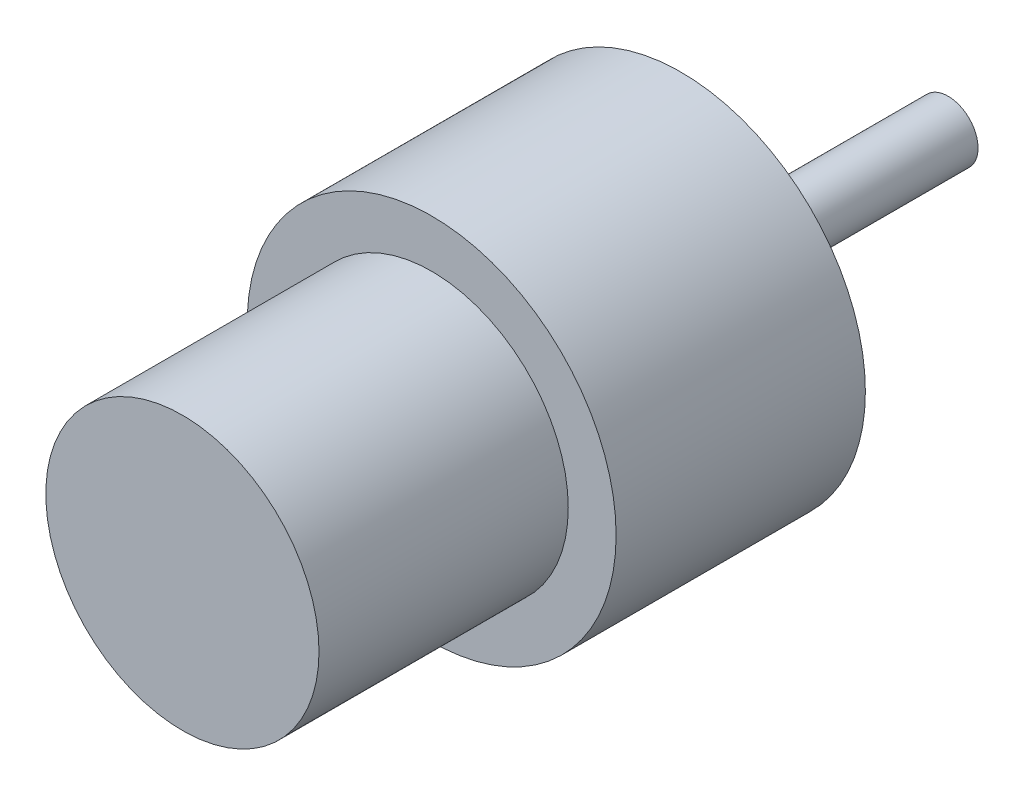
ISO-10303-21;
HEADER;
FILE_DESCRIPTION(('STEP AP214'),'2;1');
FILE_NAME('part.step','',(''),(''),'','','');
FILE_SCHEMA(('AUTOMOTIVE_DESIGN { 1 0 10303 214 1 1 1 1 }'));
ENDSEC;
DATA;
#1=APPLICATION_CONTEXT('core data for automotive mechanical design processes');
#2=APPLICATION_PROTOCOL_DEFINITION('international standard','automotive_design',2000,#1);
#3=PRODUCT_CONTEXT('',#1,'mechanical');
#4=PRODUCT('Part','Part','',(#3));
#5=PRODUCT_RELATED_PRODUCT_CATEGORY('part','',(#4));
#6=PRODUCT_DEFINITION_FORMATION('','',#4);
#7=PRODUCT_DEFINITION_CONTEXT('part definition',#1,'design');
#8=PRODUCT_DEFINITION('design','',#6,#7);
#9=PRODUCT_DEFINITION_SHAPE('','',#8);
#10=(LENGTH_UNIT() NAMED_UNIT(*) SI_UNIT(.MILLI.,.METRE.));
#11=(NAMED_UNIT(*) PLANE_ANGLE_UNIT() SI_UNIT($,.RADIAN.));
#12=(NAMED_UNIT(*) SI_UNIT($,.STERADIAN.) SOLID_ANGLE_UNIT());
#13=UNCERTAINTY_MEASURE_WITH_UNIT(LENGTH_MEASURE(1.E-05),#10,'distance_accuracy_value','');
#14=(GEOMETRIC_REPRESENTATION_CONTEXT(3) GLOBAL_UNCERTAINTY_ASSIGNED_CONTEXT((#13)) GLOBAL_UNIT_ASSIGNED_CONTEXT((#10,
#11,#12)) REPRESENTATION_CONTEXT('',''));
#15=CARTESIAN_POINT('',(0.,0.,0.));
#16=DIRECTION('',(0.,0.,1.));
#17=DIRECTION('',(1.,0.,0.));
#18=AXIS2_PLACEMENT_3D('',#15,#16,#17);
#19=CARTESIAN_POINT('',(0.,0.,25.));
#20=DIRECTION('',(0.,0.,-1.));
#21=DIRECTION('',(-1.,0.,0.));
#22=AXIS2_PLACEMENT_3D('',#19,#20,#21);
#23=CYLINDRICAL_SURFACE('',#22,18.5);
#24=CARTESIAN_POINT('',(0.,0.,25.));
#25=DIRECTION('',(0.,0.,1.));
#26=DIRECTION('',(1.,0.,0.));
#27=AXIS2_PLACEMENT_3D('',#24,#25,#26);
#28=CIRCLE('',#27,18.5);
#29=CARTESIAN_POINT('',(18.5,0.,25.));
#30=VERTEX_POINT('',#29);
#31=EDGE_CURVE('E61',#30,#30,#28,.T.);
#32=ORIENTED_EDGE('',*,*,#31,.F.);
#33=EDGE_LOOP('',(#32));
#34=FACE_BOUND('',#33,.T.);
#35=CARTESIAN_POINT('',(0.,0.,0.));
#36=DIRECTION('',(0.,0.,1.));
#37=DIRECTION('',(1.,0.,0.));
#38=AXIS2_PLACEMENT_3D('',#35,#36,#37);
#39=CIRCLE('',#38,18.5);
#40=CARTESIAN_POINT('',(18.5,0.,0.));
#41=VERTEX_POINT('',#40);
#42=EDGE_CURVE('E40',#41,#41,#39,.T.);
#43=ORIENTED_EDGE('',*,*,#42,.T.);
#44=EDGE_LOOP('',(#43));
#45=FACE_BOUND('',#44,.T.);
#46=ADVANCED_FACE('F37',(#34,#45),#23,.T.);
#47=CARTESIAN_POINT('',(0.,0.,25.));
#48=DIRECTION('',(0.,0.,1.));
#49=DIRECTION('',(1.,0.,0.));
#50=AXIS2_PLACEMENT_3D('',#47,#48,#49);
#51=PLANE('',#50);
#52=CARTESIAN_POINT('',(0.,0.,25.));
#53=DIRECTION('',(0.,0.,1.));
#54=DIRECTION('',(1.,0.,0.));
#55=AXIS2_PLACEMENT_3D('',#52,#53,#54);
#56=CIRCLE('',#55,13.7);
#57=CARTESIAN_POINT('',(13.7,0.,25.));
#58=VERTEX_POINT('',#57);
#59=EDGE_CURVE('E10',#58,#58,#56,.T.);
#60=ORIENTED_EDGE('',*,*,#59,.F.);
#61=EDGE_LOOP('',(#60));
#62=FACE_BOUND('',#61,.T.);
#63=ORIENTED_EDGE('',*,*,#31,.T.);
#64=EDGE_LOOP('',(#63));
#65=FACE_BOUND('',#64,.T.);
#66=ADVANCED_FACE('F72',(#62,#65),#51,.T.);
#67=CARTESIAN_POINT('',(0.,0.,0.));
#68=DIRECTION('',(0.,0.,1.));
#69=DIRECTION('',(1.,0.,0.));
#70=AXIS2_PLACEMENT_3D('',#67,#68,#69);
#71=PLANE('',#70);
#72=CARTESIAN_POINT('',(0.,0.,0.));
#73=DIRECTION('',(0.,0.,-1.));
#74=DIRECTION('',(-1.,0.,0.));
#75=AXIS2_PLACEMENT_3D('',#72,#73,#74);
#76=CIRCLE('',#75,6.);
#77=CARTESIAN_POINT('',(-6.,0.,0.));
#78=VERTEX_POINT('',#77);
#79=EDGE_CURVE('E49',#78,#78,#76,.T.);
#80=ORIENTED_EDGE('',*,*,#79,.F.);
#81=EDGE_LOOP('',(#80));
#82=FACE_BOUND('',#81,.T.);
#83=ORIENTED_EDGE('',*,*,#42,.F.);
#84=EDGE_LOOP('',(#83));
#85=FACE_BOUND('',#84,.T.);
#86=ADVANCED_FACE('F69',(#82,#85),#71,.F.);
#87=CARTESIAN_POINT('',(0.,0.,-6.8));
#88=DIRECTION('',(0.,0.,1.));
#89=DIRECTION('',(1.,0.,0.));
#90=AXIS2_PLACEMENT_3D('',#87,#88,#89);
#91=CYLINDRICAL_SURFACE('',#90,6.);
#92=CARTESIAN_POINT('',(0.,0.,-6.8));
#93=DIRECTION('',(0.,0.,-1.));
#94=DIRECTION('',(-1.,0.,0.));
#95=AXIS2_PLACEMENT_3D('',#92,#93,#94);
#96=CIRCLE('',#95,6.);
#97=CARTESIAN_POINT('',(-6.,0.,-6.8));
#98=VERTEX_POINT('',#97);
#99=EDGE_CURVE('E56',#98,#98,#96,.T.);
#100=ORIENTED_EDGE('',*,*,#99,.F.);
#101=EDGE_LOOP('',(#100));
#102=FACE_BOUND('',#101,.T.);
#103=ORIENTED_EDGE('',*,*,#79,.T.);
#104=EDGE_LOOP('',(#103));
#105=FACE_BOUND('',#104,.T.);
#106=ADVANCED_FACE('F71',(#102,#105),#91,.T.);
#107=CARTESIAN_POINT('',(0.,0.,-6.8));
#108=DIRECTION('',(0.,0.,-1.));
#109=DIRECTION('',(-1.,0.,0.));
#110=AXIS2_PLACEMENT_3D('',#107,#108,#109);
#111=PLANE('',#110);
#112=CARTESIAN_POINT('',(0.,0.,-6.8));
#113=DIRECTION('',(0.,0.,-1.));
#114=DIRECTION('',(-1.,0.,0.));
#115=AXIS2_PLACEMENT_3D('',#112,#113,#114);
#116=CIRCLE('',#115,3.);
#117=CARTESIAN_POINT('',(-3.,0.,-6.8));
#118=VERTEX_POINT('',#117);
#119=EDGE_CURVE('E44',#118,#118,#116,.T.);
#120=ORIENTED_EDGE('',*,*,#119,.F.);
#121=EDGE_LOOP('',(#120));
#122=FACE_BOUND('',#121,.T.);
#123=ORIENTED_EDGE('',*,*,#99,.T.);
#124=EDGE_LOOP('',(#123));
#125=FACE_BOUND('',#124,.T.);
#126=ADVANCED_FACE('F78',(#122,#125),#111,.T.);
#127=CARTESIAN_POINT('',(0.,0.,-26.8));
#128=DIRECTION('',(0.,0.,1.));
#129=DIRECTION('',(1.,0.,0.));
#130=AXIS2_PLACEMENT_3D('',#127,#128,#129);
#131=CYLINDRICAL_SURFACE('',#130,3.);
#132=CARTESIAN_POINT('',(0.,0.,-26.8));
#133=DIRECTION('',(0.,0.,-1.));
#134=DIRECTION('',(-1.,0.,0.));
#135=AXIS2_PLACEMENT_3D('',#132,#133,#134);
#136=CIRCLE('',#135,3.);
#137=CARTESIAN_POINT('',(-3.,0.,-26.8));
#138=VERTEX_POINT('',#137);
#139=EDGE_CURVE('E54',#138,#138,#136,.T.);
#140=ORIENTED_EDGE('',*,*,#139,.F.);
#141=EDGE_LOOP('',(#140));
#142=FACE_BOUND('',#141,.T.);
#143=ORIENTED_EDGE('',*,*,#119,.T.);
#144=EDGE_LOOP('',(#143));
#145=FACE_BOUND('',#144,.T.);
#146=ADVANCED_FACE('F143',(#142,#145),#131,.T.);
#147=CARTESIAN_POINT('',(0.,0.,-26.8));
#148=DIRECTION('',(0.,0.,-1.));
#149=DIRECTION('',(-1.,0.,0.));
#150=AXIS2_PLACEMENT_3D('',#147,#148,#149);
#151=PLANE('',#150);
#152=ORIENTED_EDGE('',*,*,#139,.T.);
#153=EDGE_LOOP('',(#152));
#154=FACE_BOUND('',#153,.T.);
#155=ADVANCED_FACE('F101',(#154),#151,.T.);
#156=CARTESIAN_POINT('',(0.,0.,50.));
#157=DIRECTION('',(0.,0.,-1.));
#158=DIRECTION('',(-1.,0.,0.));
#159=AXIS2_PLACEMENT_3D('',#156,#157,#158);
#160=CYLINDRICAL_SURFACE('',#159,13.7);
#161=CARTESIAN_POINT('',(0.,0.,50.));
#162=DIRECTION('',(0.,0.,1.));
#163=DIRECTION('',(1.,0.,0.));
#164=AXIS2_PLACEMENT_3D('',#161,#162,#163);
#165=CIRCLE('',#164,13.7);
#166=CARTESIAN_POINT('',(13.7,0.,50.));
#167=VERTEX_POINT('',#166);
#168=EDGE_CURVE('E53',#167,#167,#165,.T.);
#169=ORIENTED_EDGE('',*,*,#168,.F.);
#170=EDGE_LOOP('',(#169));
#171=FACE_BOUND('',#170,.T.);
#172=ORIENTED_EDGE('',*,*,#59,.T.);
#173=EDGE_LOOP('',(#172));
#174=FACE_BOUND('',#173,.T.);
#175=ADVANCED_FACE('F106',(#171,#174),#160,.T.);
#176=CARTESIAN_POINT('',(0.,0.,50.));
#177=DIRECTION('',(0.,0.,1.));
#178=DIRECTION('',(1.,0.,0.));
#179=AXIS2_PLACEMENT_3D('',#176,#177,#178);
#180=PLANE('',#179);
#181=ORIENTED_EDGE('',*,*,#168,.T.);
#182=EDGE_LOOP('',(#181));
#183=FACE_BOUND('',#182,.T.);
#184=ADVANCED_FACE('F112',(#183),#180,.T.);
#185=CLOSED_SHELL('',(#46,#66,#86,#106,#126,#146,#155,#175,#184));
#186=MANIFOLD_SOLID_BREP('B2',#185);
#187=ADVANCED_BREP_SHAPE_REPRESENTATION('',(#18,#186),#14);
#188=SHAPE_DEFINITION_REPRESENTATION(#9,#187);
ENDSEC;
END-ISO-10303-21;
